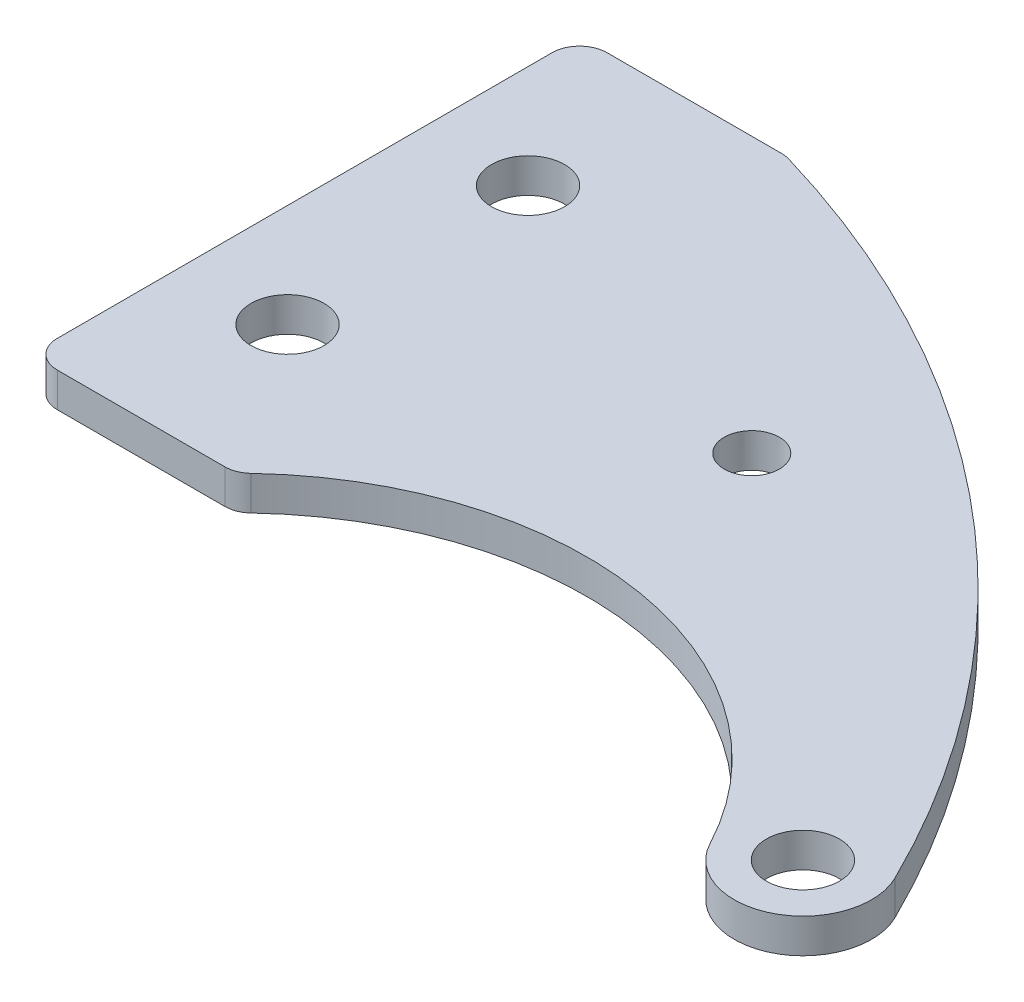
ISO-10303-21;
HEADER;
FILE_DESCRIPTION(('STEP AP214'),'2;1');
FILE_NAME('part.step','',(''),(''),'','','');
FILE_SCHEMA(('AUTOMOTIVE_DESIGN { 1 0 10303 214 1 1 1 1 }'));
ENDSEC;
DATA;
#1=APPLICATION_CONTEXT('core data for automotive mechanical design processes');
#2=APPLICATION_PROTOCOL_DEFINITION('international standard','automotive_design',2000,#1);
#3=PRODUCT_CONTEXT('',#1,'mechanical');
#4=PRODUCT('Part','Part','',(#3));
#5=PRODUCT_RELATED_PRODUCT_CATEGORY('part','',(#4));
#6=PRODUCT_DEFINITION_FORMATION('','',#4);
#7=PRODUCT_DEFINITION_CONTEXT('part definition',#1,'design');
#8=PRODUCT_DEFINITION('design','',#6,#7);
#9=PRODUCT_DEFINITION_SHAPE('','',#8);
#10=(LENGTH_UNIT() NAMED_UNIT(*) SI_UNIT(.MILLI.,.METRE.));
#11=(NAMED_UNIT(*) PLANE_ANGLE_UNIT() SI_UNIT($,.RADIAN.));
#12=(NAMED_UNIT(*) SI_UNIT($,.STERADIAN.) SOLID_ANGLE_UNIT());
#13=UNCERTAINTY_MEASURE_WITH_UNIT(LENGTH_MEASURE(1.E-05),#10,'distance_accuracy_value','');
#14=(GEOMETRIC_REPRESENTATION_CONTEXT(3) GLOBAL_UNCERTAINTY_ASSIGNED_CONTEXT((#13)) GLOBAL_UNIT_ASSIGNED_CONTEXT((#10,
#11,#12)) REPRESENTATION_CONTEXT('',''));
#15=CARTESIAN_POINT('',(0.,0.,0.));
#16=DIRECTION('',(0.,0.,1.));
#17=DIRECTION('',(1.,0.,0.));
#18=AXIS2_PLACEMENT_3D('',#15,#16,#17);
#19=CARTESIAN_POINT('',(41.9743130709679,3.175,22.8240684921653));
#20=DIRECTION('',(0.,-1.,0.));
#21=DIRECTION('',(0.,0.,-1.));
#22=AXIS2_PLACEMENT_3D('',#19,#20,#21);
#23=PLANE('',#22);
#24=CARTESIAN_POINT('',(9.525,3.175,-36.5125));
#25=DIRECTION('',(0.,1.,0.));
#26=DIRECTION('',(0.,0.,1.));
#27=AXIS2_PLACEMENT_3D('',#24,#25,#26);
#28=CIRCLE('',#27,3.3782);
#29=CARTESIAN_POINT('',(9.525,3.175,-33.1343));
#30=VERTEX_POINT('',#29);
#31=EDGE_CURVE('E240',#30,#30,#28,.T.);
#32=ORIENTED_EDGE('',*,*,#31,.F.);
#33=EDGE_LOOP('',(#32));
#34=FACE_BOUND('',#33,.T.);
#35=CARTESIAN_POINT('',(9.525,3.175,-14.2875));
#36=DIRECTION('',(0.,1.,0.));
#37=DIRECTION('',(0.,0.,1.));
#38=AXIS2_PLACEMENT_3D('',#35,#36,#37);
#39=CIRCLE('',#38,3.3782);
#40=CARTESIAN_POINT('',(9.525,3.175,-10.9093));
#41=VERTEX_POINT('',#40);
#42=EDGE_CURVE('E234',#41,#41,#39,.T.);
#43=ORIENTED_EDGE('',*,*,#42,.F.);
#44=EDGE_LOOP('',(#43));
#45=FACE_BOUND('',#44,.T.);
#46=CARTESIAN_POINT('',(76.2,3.175,4.7625));
#47=DIRECTION('',(0.,-1.,0.));
#48=DIRECTION('',(0.,0.,-1.));
#49=AXIS2_PLACEMENT_3D('',#46,#47,#48);
#50=CIRCLE('',#49,3.3782);
#51=CARTESIAN_POINT('',(76.2,3.175,1.3843));
#52=VERTEX_POINT('',#51);
#53=EDGE_CURVE('E166',#52,#52,#50,.T.);
#54=ORIENTED_EDGE('',*,*,#53,.T.);
#55=EDGE_LOOP('',(#54));
#56=FACE_BOUND('',#55,.T.);
#57=DIRECTION('',(1.,0.,0.));
#58=VECTOR('',#57,1.);
#59=CARTESIAN_POINT('',(0.,3.175,0.));
#60=LINE('',#59,#58);
#61=CARTESIAN_POINT('',(2.54,3.175,0.));
#62=VERTEX_POINT('',#61);
#63=CARTESIAN_POINT('',(18.0178707270857,3.175,0.));
#64=VERTEX_POINT('',#63);
#65=EDGE_CURVE('E140',#62,#64,#60,.T.);
#66=ORIENTED_EDGE('',*,*,#65,.T.);
#67=CARTESIAN_POINT('',(18.0178707270857,3.175,-2.54));
#68=DIRECTION('',(0.,-1.,0.));
#69=DIRECTION('',(0.,0.,-1.));
#70=AXIS2_PLACEMENT_3D('',#67,#68,#69);
#71=CIRCLE('',#70,2.54);
#72=CARTESIAN_POINT('',(19.7619517869491,3.175,-0.693440697777097));
#73=VERTEX_POINT('',#72);
#74=EDGE_CURVE('E136',#64,#73,#71,.F.);
#75=ORIENTED_EDGE('',*,*,#74,.T.);
#76=CARTESIAN_POINT('',(41.9743130709679,3.175,22.8240684921653));
#77=DIRECTION('',(0.,-1.,0.));
#78=DIRECTION('',(0.,0.,-1.));
#79=AXIS2_PLACEMENT_3D('',#76,#77,#78);
#80=CIRCLE('',#79,32.3490684921653);
#81=CARTESIAN_POINT('',(70.5840221362601,3.175,7.72616203099874));
#82=VERTEX_POINT('',#81);
#83=EDGE_CURVE('E128',#73,#82,#80,.T.);
#84=ORIENTED_EDGE('',*,*,#83,.T.);
#85=CARTESIAN_POINT('',(76.2,3.175,4.7625));
#86=DIRECTION('',(0.,1.,0.));
#87=DIRECTION('',(0.,0.,-1.));
#88=AXIS2_PLACEMENT_3D('',#85,#86,#87);
#89=CIRCLE('',#88,6.35000000000001);
#90=CARTESIAN_POINT('',(81.8991549615902,3.175,1.96211918236436));
#91=VERTEX_POINT('',#90);
#92=EDGE_CURVE('E133',#82,#91,#89,.T.);
#93=ORIENTED_EDGE('',*,*,#92,.T.);
#94=CARTESIAN_POINT('',(-9.28732442385315,3.175,46.7682122645347));
#95=DIRECTION('',(0.,1.,0.));
#96=DIRECTION('',(0.,0.,1.));
#97=AXIS2_PLACEMENT_3D('',#94,#95,#96);
#98=CIRCLE('',#97,101.6);
#99=CARTESIAN_POINT('',(19.4035506130229,3.175,-50.6966208272958));
#100=VERTEX_POINT('',#99);
#101=EDGE_CURVE('E155',#91,#100,#98,.T.);
#102=ORIENTED_EDGE('',*,*,#101,.T.);
#103=CARTESIAN_POINT('',(18.686278737101,3.175,-48.26));
#104=DIRECTION('',(0.,-1.,0.));
#105=DIRECTION('',(0.,0.,-1.));
#106=AXIS2_PLACEMENT_3D('',#103,#104,#105);
#107=CIRCLE('',#106,2.54);
#108=CARTESIAN_POINT('',(18.686278737101,3.175,-50.8));
#109=VERTEX_POINT('',#108);
#110=EDGE_CURVE('E74',#100,#109,#107,.F.);
#111=ORIENTED_EDGE('',*,*,#110,.T.);
#112=DIRECTION('',(-1.,0.,0.));
#113=VECTOR('',#112,1.);
#114=CARTESIAN_POINT('',(0.,3.175,-50.8));
#115=LINE('',#114,#113);
#116=CARTESIAN_POINT('',(2.54,3.175,-50.8));
#117=VERTEX_POINT('',#116);
#118=EDGE_CURVE('E157',#109,#117,#115,.T.);
#119=ORIENTED_EDGE('',*,*,#118,.T.);
#120=CARTESIAN_POINT('',(2.54,3.175,-48.26));
#121=DIRECTION('',(0.,-1.,0.));
#122=DIRECTION('',(0.,0.,-1.));
#123=AXIS2_PLACEMENT_3D('',#120,#121,#122);
#124=CIRCLE('',#123,2.54);
#125=CARTESIAN_POINT('',(0.,3.175,-48.26));
#126=VERTEX_POINT('',#125);
#127=EDGE_CURVE('E194',#117,#126,#124,.F.);
#128=ORIENTED_EDGE('',*,*,#127,.T.);
#129=DIRECTION('',(0.,0.,1.));
#130=VECTOR('',#129,1.);
#131=CARTESIAN_POINT('',(0.,3.175,-50.8));
#132=LINE('',#131,#130);
#133=CARTESIAN_POINT('',(0.,3.175,-2.54));
#134=VERTEX_POINT('',#133);
#135=EDGE_CURVE('E177',#126,#134,#132,.T.);
#136=ORIENTED_EDGE('',*,*,#135,.T.);
#137=CARTESIAN_POINT('',(2.54,3.175,-2.54));
#138=DIRECTION('',(0.,-1.,0.));
#139=DIRECTION('',(0.,0.,-1.));
#140=AXIS2_PLACEMENT_3D('',#137,#138,#139);
#141=CIRCLE('',#140,2.54);
#142=EDGE_CURVE('E196',#134,#62,#141,.F.);
#143=ORIENTED_EDGE('',*,*,#142,.T.);
#144=EDGE_LOOP('',(#66,#75,#84,#93,#102,#111,#119,#128,#136,#143));
#145=FACE_BOUND('',#144,.T.);
#146=CARTESIAN_POINT('',(41.275,3.175,-25.4371019068177));
#147=DIRECTION('',(0.,1.,0.));
#148=DIRECTION('',(0.,0.,1.));
#149=AXIS2_PLACEMENT_3D('',#146,#147,#148);
#150=CIRCLE('',#149,2.55269999999998);
#151=CARTESIAN_POINT('',(41.275,3.175,-22.8844019068177));
#152=VERTEX_POINT('',#151);
#153=EDGE_CURVE('E246',#152,#152,#150,.T.);
#154=ORIENTED_EDGE('',*,*,#153,.F.);
#155=EDGE_LOOP('',(#154));
#156=FACE_BOUND('',#155,.T.);
#157=ADVANCED_FACE('F53',(#34,#45,#56,#145,#156),#23,.F.);
#158=CARTESIAN_POINT('',(0.,3.175,-50.8));
#159=DIRECTION('',(1.,0.,0.));
#160=DIRECTION('',(0.,0.,-1.));
#161=AXIS2_PLACEMENT_3D('',#158,#159,#160);
#162=PLANE('',#161);
#163=DIRECTION('',(0.,0.,1.));
#164=VECTOR('',#163,1.);
#165=CARTESIAN_POINT('',(0.,0.,-50.8));
#166=LINE('',#165,#164);
#167=CARTESIAN_POINT('',(0.,0.,-48.26));
#168=VERTEX_POINT('',#167);
#169=CARTESIAN_POINT('',(0.,0.,-2.54));
#170=VERTEX_POINT('',#169);
#171=EDGE_CURVE('E162',#168,#170,#166,.T.);
#172=ORIENTED_EDGE('',*,*,#171,.T.);
#173=DIRECTION('',(0.,-1.,0.));
#174=VECTOR('',#173,1.);
#175=CARTESIAN_POINT('',(0.,3.175,-2.54));
#176=LINE('',#175,#174);
#177=EDGE_CURVE('E202',#170,#134,#176,.F.);
#178=ORIENTED_EDGE('',*,*,#177,.T.);
#179=ORIENTED_EDGE('',*,*,#135,.F.);
#180=DIRECTION('',(0.,-1.,0.));
#181=VECTOR('',#180,1.);
#182=CARTESIAN_POINT('',(0.,3.175,-48.26));
#183=LINE('',#182,#181);
#184=EDGE_CURVE('E199',#126,#168,#183,.T.);
#185=ORIENTED_EDGE('',*,*,#184,.T.);
#186=EDGE_LOOP('',(#172,#178,#179,#185));
#187=FACE_BOUND('',#186,.T.);
#188=ADVANCED_FACE('F220',(#187),#162,.F.);
#189=CARTESIAN_POINT('',(0.,3.175,0.));
#190=DIRECTION('',(0.,0.,-1.));
#191=DIRECTION('',(-1.,0.,0.));
#192=AXIS2_PLACEMENT_3D('',#189,#190,#191);
#193=PLANE('',#192);
#194=DIRECTION('',(1.,0.,0.));
#195=VECTOR('',#194,1.);
#196=CARTESIAN_POINT('',(0.,0.,0.));
#197=LINE('',#196,#195);
#198=CARTESIAN_POINT('',(2.54,0.,0.));
#199=VERTEX_POINT('',#198);
#200=CARTESIAN_POINT('',(18.0178707270857,0.,0.));
#201=VERTEX_POINT('',#200);
#202=EDGE_CURVE('E165',#199,#201,#197,.T.);
#203=ORIENTED_EDGE('',*,*,#202,.T.);
#204=DIRECTION('',(0.,-1.,0.));
#205=VECTOR('',#204,1.);
#206=CARTESIAN_POINT('',(18.0178707270857,3.175,0.));
#207=LINE('',#206,#205);
#208=EDGE_CURVE('E191',#201,#64,#207,.F.);
#209=ORIENTED_EDGE('',*,*,#208,.T.);
#210=ORIENTED_EDGE('',*,*,#65,.F.);
#211=DIRECTION('',(0.,-1.,0.));
#212=VECTOR('',#211,1.);
#213=CARTESIAN_POINT('',(2.54,3.175,0.));
#214=LINE('',#213,#212);
#215=EDGE_CURVE('E188',#62,#199,#214,.T.);
#216=ORIENTED_EDGE('',*,*,#215,.T.);
#217=EDGE_LOOP('',(#203,#209,#210,#216));
#218=FACE_BOUND('',#217,.T.);
#219=ADVANCED_FACE('F260',(#218),#193,.F.);
#220=CARTESIAN_POINT('',(41.9743130709679,3.175,22.8240684921653));
#221=DIRECTION('',(0.,-1.,0.));
#222=DIRECTION('',(0.,0.,-1.));
#223=AXIS2_PLACEMENT_3D('',#220,#221,#222);
#224=CYLINDRICAL_SURFACE('',#223,32.3490684921653);
#225=ORIENTED_EDGE('',*,*,#83,.F.);
#226=DIRECTION('',(0.,-1.,0.));
#227=VECTOR('',#226,1.);
#228=CARTESIAN_POINT('',(19.7619517869491,3.175,-0.693440697777097));
#229=LINE('',#228,#227);
#230=CARTESIAN_POINT('',(19.7619517869491,0.,-0.693440697777097));
#231=VERTEX_POINT('',#230);
#232=EDGE_CURVE('E149',#73,#231,#229,.T.);
#233=ORIENTED_EDGE('',*,*,#232,.T.);
#234=CARTESIAN_POINT('',(41.9743130709679,0.,22.8240684921653));
#235=DIRECTION('',(0.,-1.,0.));
#236=DIRECTION('',(0.,0.,-1.));
#237=AXIS2_PLACEMENT_3D('',#234,#235,#236);
#238=CIRCLE('',#237,32.3490684921653);
#239=CARTESIAN_POINT('',(70.5840221362601,0.,7.72616203099874));
#240=VERTEX_POINT('',#239);
#241=EDGE_CURVE('E146',#231,#240,#238,.T.);
#242=ORIENTED_EDGE('',*,*,#241,.T.);
#243=DIRECTION('',(0.,-1.,0.));
#244=VECTOR('',#243,1.);
#245=CARTESIAN_POINT('',(70.5840221362601,3.175,7.72616203099874));
#246=LINE('',#245,#244);
#247=EDGE_CURVE('E143',#82,#240,#246,.T.);
#248=ORIENTED_EDGE('',*,*,#247,.F.);
#249=EDGE_LOOP('',(#225,#233,#242,#248));
#250=FACE_BOUND('',#249,.T.);
#251=ADVANCED_FACE('F144',(#250),#224,.F.);
#252=CARTESIAN_POINT('',(76.2,3.175,4.7625));
#253=DIRECTION('',(0.,-1.,0.));
#254=DIRECTION('',(0.,0.,-1.));
#255=AXIS2_PLACEMENT_3D('',#252,#253,#254);
#256=CYLINDRICAL_SURFACE('',#255,6.35000000000001);
#257=CARTESIAN_POINT('',(76.2,0.,4.7625));
#258=DIRECTION('',(0.,1.,0.));
#259=DIRECTION('',(0.,0.,-1.));
#260=AXIS2_PLACEMENT_3D('',#257,#258,#259);
#261=CIRCLE('',#260,6.35000000000001);
#262=CARTESIAN_POINT('',(81.8991549615902,0.,1.96211918236436));
#263=VERTEX_POINT('',#262);
#264=EDGE_CURVE('E170',#240,#263,#261,.T.);
#265=ORIENTED_EDGE('',*,*,#264,.T.);
#266=DIRECTION('',(0.,-1.,0.));
#267=VECTOR('',#266,1.);
#268=CARTESIAN_POINT('',(81.8991549615902,3.175,1.96211918236436));
#269=LINE('',#268,#267);
#270=EDGE_CURVE('E150',#91,#263,#269,.T.);
#271=ORIENTED_EDGE('',*,*,#270,.F.);
#272=ORIENTED_EDGE('',*,*,#92,.F.);
#273=ORIENTED_EDGE('',*,*,#247,.T.);
#274=EDGE_LOOP('',(#265,#271,#272,#273));
#275=FACE_BOUND('',#274,.T.);
#276=ADVANCED_FACE('F152',(#275),#256,.T.);
#277=CARTESIAN_POINT('',(-9.28732442385315,3.175,46.7682122645347));
#278=DIRECTION('',(0.,-1.,0.));
#279=DIRECTION('',(0.,0.,-1.));
#280=AXIS2_PLACEMENT_3D('',#277,#278,#279);
#281=CYLINDRICAL_SURFACE('',#280,101.6);
#282=CARTESIAN_POINT('',(-9.28732442385315,0.,46.7682122645347));
#283=DIRECTION('',(0.,1.,0.));
#284=DIRECTION('',(0.,0.,1.));
#285=AXIS2_PLACEMENT_3D('',#282,#283,#284);
#286=CIRCLE('',#285,101.6);
#287=CARTESIAN_POINT('',(19.4035506130229,0.,-50.6966208272958));
#288=VERTEX_POINT('',#287);
#289=EDGE_CURVE('E172',#263,#288,#286,.T.);
#290=ORIENTED_EDGE('',*,*,#289,.T.);
#291=DIRECTION('',(0.,-1.,0.));
#292=VECTOR('',#291,1.);
#293=CARTESIAN_POINT('',(19.4035506130229,3.175,-50.6966208272958));
#294=LINE('',#293,#292);
#295=EDGE_CURVE('E11',#288,#100,#294,.F.);
#296=ORIENTED_EDGE('',*,*,#295,.T.);
#297=ORIENTED_EDGE('',*,*,#101,.F.);
#298=ORIENTED_EDGE('',*,*,#270,.T.);
#299=EDGE_LOOP('',(#290,#296,#297,#298));
#300=FACE_BOUND('',#299,.T.);
#301=ADVANCED_FACE('F272',(#300),#281,.T.);
#302=CARTESIAN_POINT('',(0.,3.175,-50.8));
#303=DIRECTION('',(0.,0.,1.));
#304=DIRECTION('',(1.,0.,0.));
#305=AXIS2_PLACEMENT_3D('',#302,#303,#304);
#306=PLANE('',#305);
#307=DIRECTION('',(-1.,0.,0.));
#308=VECTOR('',#307,1.);
#309=CARTESIAN_POINT('',(0.,0.,-50.8));
#310=LINE('',#309,#308);
#311=CARTESIAN_POINT('',(18.686278737101,0.,-50.8));
#312=VERTEX_POINT('',#311);
#313=CARTESIAN_POINT('',(2.54,0.,-50.8));
#314=VERTEX_POINT('',#313);
#315=EDGE_CURVE('E175',#312,#314,#310,.T.);
#316=ORIENTED_EDGE('',*,*,#315,.T.);
#317=DIRECTION('',(0.,-1.,0.));
#318=VECTOR('',#317,1.);
#319=CARTESIAN_POINT('',(2.54,3.175,-50.8));
#320=LINE('',#319,#318);
#321=EDGE_CURVE('E61',#314,#117,#320,.F.);
#322=ORIENTED_EDGE('',*,*,#321,.T.);
#323=ORIENTED_EDGE('',*,*,#118,.F.);
#324=DIRECTION('',(0.,-1.,0.));
#325=VECTOR('',#324,1.);
#326=CARTESIAN_POINT('',(18.686278737101,3.175,-50.8));
#327=LINE('',#326,#325);
#328=EDGE_CURVE('E204',#109,#312,#327,.T.);
#329=ORIENTED_EDGE('',*,*,#328,.T.);
#330=EDGE_LOOP('',(#316,#322,#323,#329));
#331=FACE_BOUND('',#330,.T.);
#332=ADVANCED_FACE('F208',(#331),#306,.F.);
#333=CARTESIAN_POINT('',(41.9743130709679,0.,22.8240684921653));
#334=DIRECTION('',(0.,-1.,0.));
#335=DIRECTION('',(0.,0.,-1.));
#336=AXIS2_PLACEMENT_3D('',#333,#334,#335);
#337=PLANE('',#336);
#338=CARTESIAN_POINT('',(41.275,0.,-25.4371019068177));
#339=DIRECTION('',(0.,-1.,0.));
#340=DIRECTION('',(0.,0.,-1.));
#341=AXIS2_PLACEMENT_3D('',#338,#339,#340);
#342=CIRCLE('',#341,2.55269999999999);
#343=CARTESIAN_POINT('',(41.275,0.,-27.9898019068177));
#344=VERTEX_POINT('',#343);
#345=EDGE_CURVE('E243',#344,#344,#342,.T.);
#346=ORIENTED_EDGE('',*,*,#345,.F.);
#347=EDGE_LOOP('',(#346));
#348=FACE_BOUND('',#347,.T.);
#349=CARTESIAN_POINT('',(9.525,0.,-36.5125));
#350=DIRECTION('',(0.,1.,0.));
#351=DIRECTION('',(0.,0.,1.));
#352=AXIS2_PLACEMENT_3D('',#349,#350,#351);
#353=CIRCLE('',#352,3.3782);
#354=CARTESIAN_POINT('',(9.525,0.,-33.1343));
#355=VERTEX_POINT('',#354);
#356=EDGE_CURVE('E237',#355,#355,#353,.T.);
#357=ORIENTED_EDGE('',*,*,#356,.T.);
#358=EDGE_LOOP('',(#357));
#359=FACE_BOUND('',#358,.T.);
#360=CARTESIAN_POINT('',(9.525,0.,-14.2875));
#361=DIRECTION('',(0.,1.,0.));
#362=DIRECTION('',(0.,0.,1.));
#363=AXIS2_PLACEMENT_3D('',#360,#361,#362);
#364=CIRCLE('',#363,3.3782);
#365=CARTESIAN_POINT('',(9.525,0.,-10.9093));
#366=VERTEX_POINT('',#365);
#367=EDGE_CURVE('E231',#366,#366,#364,.T.);
#368=ORIENTED_EDGE('',*,*,#367,.T.);
#369=EDGE_LOOP('',(#368));
#370=FACE_BOUND('',#369,.T.);
#371=CARTESIAN_POINT('',(76.2,0.,4.7625));
#372=DIRECTION('',(0.,-1.,0.));
#373=DIRECTION('',(0.,0.,-1.));
#374=AXIS2_PLACEMENT_3D('',#371,#372,#373);
#375=CIRCLE('',#374,3.3782);
#376=CARTESIAN_POINT('',(76.2,0.,1.3843));
#377=VERTEX_POINT('',#376);
#378=EDGE_CURVE('E228',#377,#377,#375,.T.);
#379=ORIENTED_EDGE('',*,*,#378,.F.);
#380=EDGE_LOOP('',(#379));
#381=FACE_BOUND('',#380,.T.);
#382=ORIENTED_EDGE('',*,*,#241,.F.);
#383=CARTESIAN_POINT('',(18.0178707270857,0.,-2.54));
#384=DIRECTION('',(0.,-1.,0.));
#385=DIRECTION('',(0.,0.,-1.));
#386=AXIS2_PLACEMENT_3D('',#383,#384,#385);
#387=CIRCLE('',#386,2.54);
#388=EDGE_CURVE('E186',#231,#201,#387,.T.);
#389=ORIENTED_EDGE('',*,*,#388,.T.);
#390=ORIENTED_EDGE('',*,*,#202,.F.);
#391=CARTESIAN_POINT('',(2.54,0.,-2.54));
#392=DIRECTION('',(0.,-1.,0.));
#393=DIRECTION('',(0.,0.,-1.));
#394=AXIS2_PLACEMENT_3D('',#391,#392,#393);
#395=CIRCLE('',#394,2.54);
#396=EDGE_CURVE('E184',#199,#170,#395,.T.);
#397=ORIENTED_EDGE('',*,*,#396,.T.);
#398=ORIENTED_EDGE('',*,*,#171,.F.);
#399=CARTESIAN_POINT('',(2.54,0.,-48.26));
#400=DIRECTION('',(0.,-1.,0.));
#401=DIRECTION('',(0.,0.,-1.));
#402=AXIS2_PLACEMENT_3D('',#399,#400,#401);
#403=CIRCLE('',#402,2.54);
#404=EDGE_CURVE('E182',#168,#314,#403,.T.);
#405=ORIENTED_EDGE('',*,*,#404,.T.);
#406=ORIENTED_EDGE('',*,*,#315,.F.);
#407=CARTESIAN_POINT('',(18.686278737101,0.,-48.26));
#408=DIRECTION('',(0.,-1.,0.));
#409=DIRECTION('',(0.,0.,-1.));
#410=AXIS2_PLACEMENT_3D('',#407,#408,#409);
#411=CIRCLE('',#410,2.54);
#412=EDGE_CURVE('E180',#312,#288,#411,.T.);
#413=ORIENTED_EDGE('',*,*,#412,.T.);
#414=ORIENTED_EDGE('',*,*,#289,.F.);
#415=ORIENTED_EDGE('',*,*,#264,.F.);
#416=EDGE_LOOP('',(#382,#389,#390,#397,#398,#405,#406,#413,#414,#415));
#417=FACE_BOUND('',#416,.T.);
#418=ADVANCED_FACE('F211',(#348,#359,#370,#381,#417),#337,.T.);
#419=CARTESIAN_POINT('',(76.2,0.,4.7625));
#420=DIRECTION('',(0.,-1.,0.));
#421=DIRECTION('',(0.,0.,-1.));
#422=AXIS2_PLACEMENT_3D('',#419,#420,#421);
#423=CYLINDRICAL_SURFACE('',#422,3.3782);
#424=ORIENTED_EDGE('',*,*,#53,.F.);
#425=EDGE_LOOP('',(#424));
#426=FACE_BOUND('',#425,.T.);
#427=ORIENTED_EDGE('',*,*,#378,.T.);
#428=EDGE_LOOP('',(#427));
#429=FACE_BOUND('',#428,.T.);
#430=ADVANCED_FACE('F266',(#426,#429),#423,.F.);
#431=CARTESIAN_POINT('',(9.525,3.175,-14.2875));
#432=DIRECTION('',(0.,1.,0.));
#433=DIRECTION('',(0.,0.,1.));
#434=AXIS2_PLACEMENT_3D('',#431,#432,#433);
#435=CYLINDRICAL_SURFACE('',#434,3.3782);
#436=ORIENTED_EDGE('',*,*,#367,.F.);
#437=EDGE_LOOP('',(#436));
#438=FACE_BOUND('',#437,.T.);
#439=ORIENTED_EDGE('',*,*,#42,.T.);
#440=EDGE_LOOP('',(#439));
#441=FACE_BOUND('',#440,.T.);
#442=ADVANCED_FACE('F308',(#438,#441),#435,.F.);
#443=CARTESIAN_POINT('',(9.525,3.175,-36.5125));
#444=DIRECTION('',(0.,1.,0.));
#445=DIRECTION('',(0.,0.,1.));
#446=AXIS2_PLACEMENT_3D('',#443,#444,#445);
#447=CYLINDRICAL_SURFACE('',#446,3.3782);
#448=ORIENTED_EDGE('',*,*,#356,.F.);
#449=EDGE_LOOP('',(#448));
#450=FACE_BOUND('',#449,.T.);
#451=ORIENTED_EDGE('',*,*,#31,.T.);
#452=EDGE_LOOP('',(#451));
#453=FACE_BOUND('',#452,.T.);
#454=ADVANCED_FACE('F287',(#450,#453),#447,.F.);
#455=CARTESIAN_POINT('',(18.0178707270857,3.175,-2.54));
#456=DIRECTION('',(0.,-1.,0.));
#457=DIRECTION('',(0.,0.,-1.));
#458=AXIS2_PLACEMENT_3D('',#455,#456,#457);
#459=CYLINDRICAL_SURFACE('',#458,2.54);
#460=ORIENTED_EDGE('',*,*,#74,.F.);
#461=ORIENTED_EDGE('',*,*,#208,.F.);
#462=ORIENTED_EDGE('',*,*,#388,.F.);
#463=ORIENTED_EDGE('',*,*,#232,.F.);
#464=EDGE_LOOP('',(#460,#461,#462,#463));
#465=FACE_BOUND('',#464,.T.);
#466=ADVANCED_FACE('F283',(#465),#459,.T.);
#467=CARTESIAN_POINT('',(2.54,3.175,-2.54));
#468=DIRECTION('',(0.,-1.,0.));
#469=DIRECTION('',(0.,0.,-1.));
#470=AXIS2_PLACEMENT_3D('',#467,#468,#469);
#471=CYLINDRICAL_SURFACE('',#470,2.54);
#472=ORIENTED_EDGE('',*,*,#142,.F.);
#473=ORIENTED_EDGE('',*,*,#177,.F.);
#474=ORIENTED_EDGE('',*,*,#396,.F.);
#475=ORIENTED_EDGE('',*,*,#215,.F.);
#476=EDGE_LOOP('',(#472,#473,#474,#475));
#477=FACE_BOUND('',#476,.T.);
#478=ADVANCED_FACE('F286',(#477),#471,.T.);
#479=CARTESIAN_POINT('',(2.54,3.175,-48.26));
#480=DIRECTION('',(0.,-1.,0.));
#481=DIRECTION('',(0.,0.,-1.));
#482=AXIS2_PLACEMENT_3D('',#479,#480,#481);
#483=CYLINDRICAL_SURFACE('',#482,2.54);
#484=ORIENTED_EDGE('',*,*,#127,.F.);
#485=ORIENTED_EDGE('',*,*,#321,.F.);
#486=ORIENTED_EDGE('',*,*,#404,.F.);
#487=ORIENTED_EDGE('',*,*,#184,.F.);
#488=EDGE_LOOP('',(#484,#485,#486,#487));
#489=FACE_BOUND('',#488,.T.);
#490=ADVANCED_FACE('F217',(#489),#483,.T.);
#491=CARTESIAN_POINT('',(18.686278737101,3.175,-48.26));
#492=DIRECTION('',(0.,-1.,0.));
#493=DIRECTION('',(0.,0.,-1.));
#494=AXIS2_PLACEMENT_3D('',#491,#492,#493);
#495=CYLINDRICAL_SURFACE('',#494,2.54);
#496=ORIENTED_EDGE('',*,*,#110,.F.);
#497=ORIENTED_EDGE('',*,*,#295,.F.);
#498=ORIENTED_EDGE('',*,*,#412,.F.);
#499=ORIENTED_EDGE('',*,*,#328,.F.);
#500=EDGE_LOOP('',(#496,#497,#498,#499));
#501=FACE_BOUND('',#500,.T.);
#502=ADVANCED_FACE('F55',(#501),#495,.T.);
#503=CARTESIAN_POINT('',(41.275,3.175,-25.4371019068177));
#504=DIRECTION('',(0.,1.,0.));
#505=DIRECTION('',(0.,0.,1.));
#506=AXIS2_PLACEMENT_3D('',#503,#504,#505);
#507=CYLINDRICAL_SURFACE('',#506,2.55269999999999);
#508=ORIENTED_EDGE('',*,*,#153,.T.);
#509=EDGE_LOOP('',(#508));
#510=FACE_BOUND('',#509,.T.);
#511=ORIENTED_EDGE('',*,*,#345,.T.);
#512=EDGE_LOOP('',(#511));
#513=FACE_BOUND('',#512,.T.);
#514=ADVANCED_FACE('F250',(#510,#513),#507,.F.);
#515=CLOSED_SHELL('',(#157,#188,#219,#251,#276,#301,#332,#418,#430,#442,#454,#466,#478,#490,
#502,#514));
#516=MANIFOLD_SOLID_BREP('B2',#515);
#517=ADVANCED_BREP_SHAPE_REPRESENTATION('',(#18,#516),#14);
#518=SHAPE_DEFINITION_REPRESENTATION(#9,#517);
ENDSEC;
END-ISO-10303-21;
